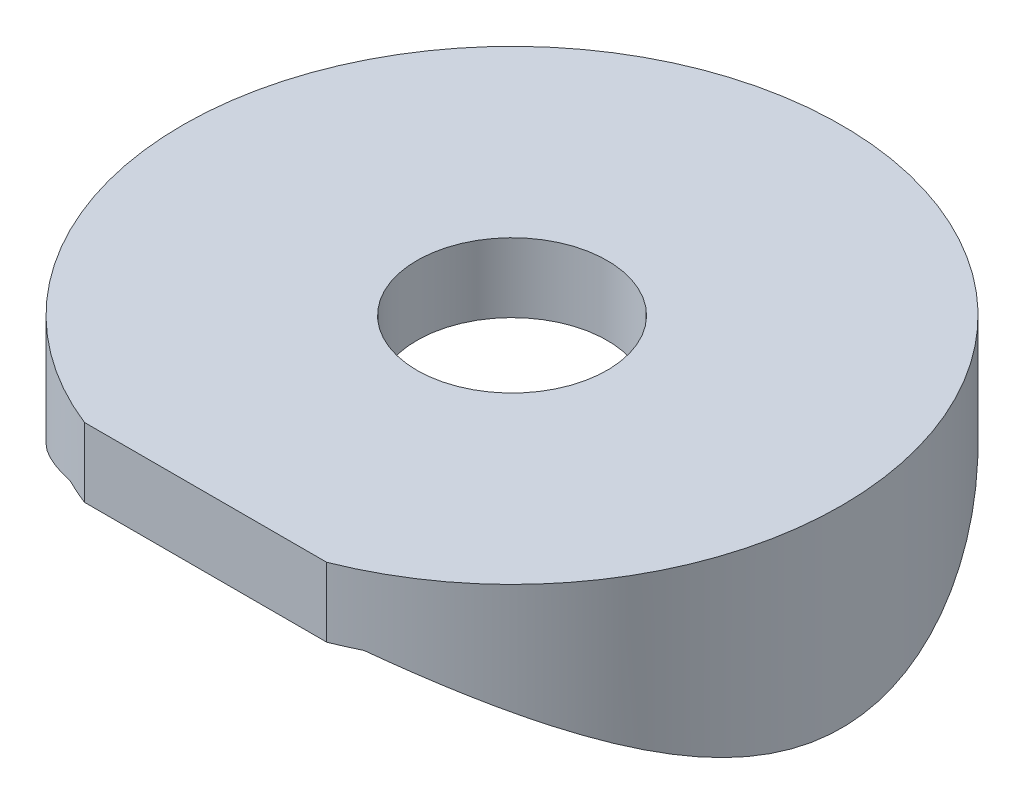
ISO-10303-21;
HEADER;
FILE_DESCRIPTION(('STEP AP214'),'2;1');
FILE_NAME('part.step','',(''),(''),'','','');
FILE_SCHEMA(('AUTOMOTIVE_DESIGN { 1 0 10303 214 1 1 1 1 }'));
ENDSEC;
DATA;
#1=APPLICATION_CONTEXT('core data for automotive mechanical design processes');
#2=APPLICATION_PROTOCOL_DEFINITION('international standard','automotive_design',2000,#1);
#3=PRODUCT_CONTEXT('',#1,'mechanical');
#4=PRODUCT('Part','Part','',(#3));
#5=PRODUCT_RELATED_PRODUCT_CATEGORY('part','',(#4));
#6=PRODUCT_DEFINITION_FORMATION('','',#4);
#7=PRODUCT_DEFINITION_CONTEXT('part definition',#1,'design');
#8=PRODUCT_DEFINITION('design','',#6,#7);
#9=PRODUCT_DEFINITION_SHAPE('','',#8);
#10=(LENGTH_UNIT() NAMED_UNIT(*) SI_UNIT(.MILLI.,.METRE.));
#11=(NAMED_UNIT(*) PLANE_ANGLE_UNIT() SI_UNIT($,.RADIAN.));
#12=(NAMED_UNIT(*) SI_UNIT($,.STERADIAN.) SOLID_ANGLE_UNIT());
#13=UNCERTAINTY_MEASURE_WITH_UNIT(LENGTH_MEASURE(1.E-05),#10,'distance_accuracy_value','');
#14=(GEOMETRIC_REPRESENTATION_CONTEXT(3) GLOBAL_UNCERTAINTY_ASSIGNED_CONTEXT((#13)) GLOBAL_UNIT_ASSIGNED_CONTEXT((#10,
#11,#12)) REPRESENTATION_CONTEXT('',''));
#15=CARTESIAN_POINT('',(0.,0.,0.));
#16=DIRECTION('',(0.,0.,1.));
#17=DIRECTION('',(1.,0.,0.));
#18=AXIS2_PLACEMENT_3D('',#15,#16,#17);
#19=CARTESIAN_POINT('',(0.,2.,0.));
#20=DIRECTION('',(0.,-1.,0.));
#21=DIRECTION('',(0.,0.,-1.));
#22=AXIS2_PLACEMENT_3D('',#19,#20,#21);
#23=CYLINDRICAL_SURFACE('',#22,9.525);
#24=CARTESIAN_POINT('',(0.,0.,0.));
#25=DIRECTION('',(0.,1.,0.));
#26=DIRECTION('',(0.,0.,1.));
#27=AXIS2_PLACEMENT_3D('',#24,#25,#26);
#28=CIRCLE('',#27,9.525);
#29=CARTESIAN_POINT('',(-4.24371299732805,0.,8.52739848935823));
#30=VERTEX_POINT('',#29);
#31=CARTESIAN_POINT('',(-3.5,0.,8.85864690570744));
#32=VERTEX_POINT('',#31);
#33=EDGE_CURVE('E97',#30,#32,#28,.T.);
#34=ORIENTED_EDGE('',*,*,#33,.T.);
#35=DIRECTION('',(0.,1.,0.));
#36=VECTOR('',#35,1.);
#37=CARTESIAN_POINT('',(-3.5,-4.28727802149109,8.85864690570744));
#38=LINE('',#37,#36);
#39=CARTESIAN_POINT('',(-3.5,2.,8.85864690570744));
#40=VERTEX_POINT('',#39);
#41=EDGE_CURVE('E57',#32,#40,#38,.T.);
#42=ORIENTED_EDGE('',*,*,#41,.T.);
#43=CARTESIAN_POINT('',(0.,2.,0.));
#44=DIRECTION('',(0.,1.,0.));
#45=DIRECTION('',(0.,0.,1.));
#46=AXIS2_PLACEMENT_3D('',#43,#44,#45);
#47=CIRCLE('',#46,9.525);
#48=CARTESIAN_POINT('',(3.5,2.,8.85864690570744));
#49=VERTEX_POINT('',#48);
#50=EDGE_CURVE('E50',#49,#40,#47,.T.);
#51=ORIENTED_EDGE('',*,*,#50,.F.);
#52=DIRECTION('',(0.,1.,0.));
#53=VECTOR('',#52,1.);
#54=CARTESIAN_POINT('',(3.5,-4.28727802149109,8.85864690570744));
#55=LINE('',#54,#53);
#56=CARTESIAN_POINT('',(3.5,0.,8.85864690570744));
#57=VERTEX_POINT('',#56);
#58=EDGE_CURVE('E80',#57,#49,#55,.T.);
#59=ORIENTED_EDGE('',*,*,#58,.F.);
#60=CARTESIAN_POINT('',(4.24371299645719,0.,8.52739848979162));
#61=VERTEX_POINT('',#60);
#62=EDGE_CURVE('E98',#57,#61,#28,.T.);
#63=ORIENTED_EDGE('',*,*,#62,.T.);
#64=CARTESIAN_POINT('',(0.,0.729999999999805,9.525));
#65=CARTESIAN_POINT('',(-0.23259841021261,0.729997784888119,9.52499770537466));
#66=CARTESIAN_POINT('',(-0.465255043655227,0.723594419249515,9.51646441280729));
#67=CARTESIAN_POINT('',(-0.928731542195356,0.698124794112433,9.48246454254012));
#68=CARTESIAN_POINT('',(-1.15955022455056,0.679050957577417,9.45698783253917));
#69=CARTESIAN_POINT('',(-1.61788138906219,0.628639507989334,9.38945410865459));
#70=CARTESIAN_POINT('',(-1.84538601283839,0.597276517735044,9.3473627841225));
#71=CARTESIAN_POINT('',(-2.2949502467773,0.52300312294065,9.2472632046122));
#72=CARTESIAN_POINT('',(-2.51700921202464,0.480091357845787,9.18925307423248));
#73=CARTESIAN_POINT('',(-2.952876191942,0.383947739227021,9.05856475719301));
#74=CARTESIAN_POINT('',(-3.16672702845038,0.330781918974894,8.98598030840878));
#75=CARTESIAN_POINT('',(-3.58650782409441,0.215006184306209,8.82683302994353));
#76=CARTESIAN_POINT('',(-3.79243753835999,0.152395978224062,8.74026976855698));
#77=CARTESIAN_POINT('',(-4.19537242078881,0.0189061872306335,8.55416263233198));
#78=CARTESIAN_POINT('',(-4.39238304194526,-0.0519682476247925,8.45462683713943));
#79=CARTESIAN_POINT('',(-4.77703365277123,-0.200866503976882,8.24340590595757));
#80=CARTESIAN_POINT('',(-4.96467037097833,-0.278892794887664,8.13171657104755));
#81=CARTESIAN_POINT('',(-5.34692015142942,-0.448364136168589,7.8862109865343));
#82=CARTESIAN_POINT('',(-5.54057769571428,-0.540382977212998,7.75130388741133));
#83=CARTESIAN_POINT('',(-5.91568315666102,-0.729943727724393,7.46896507493376));
#84=CARTESIAN_POINT('',(-6.09712948397992,-0.827486353105227,7.3215317368628));
#85=CARTESIAN_POINT('',(-6.44778420778648,-1.02665526255018,7.01470349487024));
#86=CARTESIAN_POINT('',(-6.61697329942977,-1.12828761242709,6.85529049451129));
#87=CARTESIAN_POINT('',(-6.94253873875901,-1.3338253101456,6.52537216797456));
#88=CARTESIAN_POINT('',(-7.09891856081364,-1.43773003187955,6.35486987230249));
#89=CARTESIAN_POINT('',(-7.42924361454595,-1.6673503710911,5.96735473559504));
#90=CARTESIAN_POINT('',(-7.60028683020509,-1.79320133907598,5.74793814875554));
#91=CARTESIAN_POINT('',(-7.92317135810628,-2.04251439300869,5.2940157499132));
#92=CARTESIAN_POINT('',(-8.07500688013017,-2.16597574914572,5.05950541984679));
#93=CARTESIAN_POINT('',(-8.35856892365196,-2.40658801370607,4.57585064368803));
#94=CARTESIAN_POINT('',(-8.4903155443376,-2.52374515259294,4.32672117454368));
#95=CARTESIAN_POINT('',(-8.73266391869301,-2.74732401379134,3.81400842020836));
#96=CARTESIAN_POINT('',(-8.84327771031342,-2.85375183145663,3.55043347441776));
#97=CARTESIAN_POINT('',(-9.0728908228853,-3.0814481821903,2.92423440351913));
#98=CARTESIAN_POINT('',(-9.18375570493701,-3.19700125106876,2.55634618968797));
#99=CARTESIAN_POINT('',(-9.31693272394488,-3.33929966169199,1.98949342968806));
#100=CARTESIAN_POINT('',(-9.35579238340954,-3.38154546641803,1.79815152694915));
#101=CARTESIAN_POINT('',(-9.42190755651968,-3.45412803329214,1.41128534341628));
#102=CARTESIAN_POINT('',(-9.44916905018073,-3.48447093194927,1.21576327266876));
#103=CARTESIAN_POINT('',(-9.49175093121314,-3.53212661427137,0.819931641701291));
#104=CARTESIAN_POINT('',(-9.50695584288829,-3.54931333772008,0.619594283029923));
#105=CARTESIAN_POINT('',(-9.52463756517548,-3.56931773946365,0.217634688525825));
#106=CARTESIAN_POINT('',(-9.5271147250272,-3.57213581202318,0.0160124881001599));
#107=CARTESIAN_POINT('',(-9.51927797471908,-3.56325395273591,-0.386721449746217));
#108=CARTESIAN_POINT('',(-9.50895987824097,-3.55154926937138,-0.587832998516868));
#109=CARTESIAN_POINT('',(-9.47577623693442,-3.51421608975241,-0.987696956026981));
#110=CARTESIAN_POINT('',(-9.45291056426838,-3.48858745163753,-1.18644934070965));
#111=CARTESIAN_POINT('',(-9.39823752218467,-3.42806853030904,-1.55894115029253));
#112=CARTESIAN_POINT('',(-9.36765398503441,-3.39446829507869,-1.73307473267046));
#113=CARTESIAN_POINT('',(-9.29733840592979,-3.31828412768323,-2.07751040135897));
#114=CARTESIAN_POINT('',(-9.25760310062014,-3.27569699140634,-2.24781109709618));
#115=CARTESIAN_POINT('',(-9.1253348977206,-3.13627797752672,-2.75221284378597));
#116=CARTESIAN_POINT('',(-9.01974467644837,-3.02779425009011,-3.07978065848045));
#117=CARTESIAN_POINT('',(-8.80004440363324,-2.81203662342191,-3.65531877636064));
#118=CARTESIAN_POINT('',(-8.69120308439111,-2.70831623291411,-3.90673413666691));
#119=CARTESIAN_POINT('',(-8.45417087506931,-2.49145559781081,-4.39619617473415));
#120=CARTESIAN_POINT('',(-8.32597006151514,-2.37831053564163,-4.63423590992921));
#121=CARTESIAN_POINT('',(-8.05095146899372,-2.14632334880252,-5.0971022097166));
#122=CARTESIAN_POINT('',(-7.90409559569967,-2.02746988523204,-5.32190031942103));
#123=CARTESIAN_POINT('',(-7.59262434407657,-1.78762834741461,-5.75754782188368));
#124=CARTESIAN_POINT('',(-7.42801175020223,-1.66664061032761,-5.96839939327584));
#125=CARTESIAN_POINT('',(-7.07704198235579,-1.42237752024943,-6.38093102297909));
#126=CARTESIAN_POINT('',(-6.8902407182611,-1.29912153943826,-6.58224508385465));
#127=CARTESIAN_POINT('',(-6.49870467122047,-1.05625102841345,-6.96908847989323));
#128=CARTESIAN_POINT('',(-6.29396807626398,-0.936636867782604,-7.154616216419));
#129=CARTESIAN_POINT('',(-5.86731757424881,-0.703965573125999,-7.50845411558424));
#130=CARTESIAN_POINT('',(-5.64543332705745,-0.590897683703235,-7.67679288824356));
#131=CARTESIAN_POINT('',(-5.1847666626012,-0.373750997506853,-7.99513322842824));
#132=CARTESIAN_POINT('',(-4.94598858625621,-0.269669906700883,-8.14513947972538));
#133=CARTESIAN_POINT('',(-4.50194089752363,-0.0928099684937161,-8.39699949060933));
#134=CARTESIAN_POINT('',(-4.29955325197172,-0.0179393545510051,-8.50247725145005));
#135=CARTESIAN_POINT('',(-3.88524637166804,0.123085541359482,-8.69960271376244));
#136=CARTESIAN_POINT('',(-3.67332910828406,0.189241615056706,-8.79125325870626));
#137=CARTESIAN_POINT('',(-3.24094504112411,0.31156060210267,-8.95967102713244));
#138=CARTESIAN_POINT('',(-3.02048147525959,0.367727255904571,-9.03644382243031));
#139=CARTESIAN_POINT('',(-2.57214112585905,0.468926522423023,-9.17413201803592));
#140=CARTESIAN_POINT('',(-2.34426424715868,0.513958992146676,-9.23504721468993));
#141=CARTESIAN_POINT('',(-1.88117485035226,0.592111886440313,-9.34042496004337));
#142=CARTESIAN_POINT('',(-1.64592540399988,0.625156151843665,-9.38478236945888));
#143=CARTESIAN_POINT('',(-1.17129174753272,0.678125875778509,-9.45575338516204));
#144=CARTESIAN_POINT('',(-0.931907527351278,0.698051302365816,-9.48236694824367));
#145=CARTESIAN_POINT('',(-0.451142730954666,0.724266652119009,-9.51736126052943));
#146=CARTESIAN_POINT('',(-0.209762847438576,0.73056112233819,-9.52574808986271));
#147=CARTESIAN_POINT('',(0.272890152536329,0.72936043157876,-9.52414731523175));
#148=CARTESIAN_POINT('',(0.514163275909657,0.721866357204784,-9.51416115914847));
#149=CARTESIAN_POINT('',(0.970221531004669,0.694734031875467,-9.47793420082518));
#150=CARTESIAN_POINT('',(1.18522594166334,0.676395578326863,-9.45343269025608));
#151=CARTESIAN_POINT('',(1.61193413475926,0.629116805106362,-9.39009127706114));
#152=CARTESIAN_POINT('',(1.82363781860707,0.600176169387875,-9.35125094700086));
#153=CARTESIAN_POINT('',(2.24240408758311,0.532264940695811,-9.25976200832545));
#154=CARTESIAN_POINT('',(2.44946630605082,0.493293558340478,-9.20711231295937));
#155=CARTESIAN_POINT('',(2.85778253134699,0.406052442909976,-9.08866888869828));
#156=CARTESIAN_POINT('',(3.05903624736119,0.357782245196468,-9.02287450299018));
#157=CARTESIAN_POINT('',(3.4617083269491,0.250943607375551,-8.87635576558735));
#158=CARTESIAN_POINT('',(3.66288564193724,0.192073722945955,-8.79518925903764));
#159=CARTESIAN_POINT('',(4.05718446805025,0.0662840212472638,-8.6204077023608));
#160=CARTESIAN_POINT('',(4.25030324937319,-0.000638494485306451,-8.52678847817238));
#161=CARTESIAN_POINT('',(4.81639459045338,-0.211839639111846,-8.2285927945998));
#162=CARTESIAN_POINT('',(5.17640496565212,-0.366634718909772,-8.00656644797463));
#163=CARTESIAN_POINT('',(5.91519395536679,-0.722972839233144,-7.48161937180489));
#164=CARTESIAN_POINT('',(6.28706649731194,-0.928005707306838,-7.17138137049225));
#165=CARTESIAN_POINT('',(6.80424268305122,-1.24463586284191,-6.66976691930901));
#166=CARTESIAN_POINT('',(6.97007726772597,-1.35185774053343,-6.49623611811186));
#167=CARTESIAN_POINT('',(7.28787473292322,-1.56741903807525,-6.13757980417725));
#168=CARTESIAN_POINT('',(7.43984095984432,-1.67575818127239,-5.95245710680976));
#169=CARTESIAN_POINT('',(7.75723803959675,-1.91209280619687,-5.53463917245937));
#170=CARTESIAN_POINT('',(7.91972498285248,-2.03990407083125,-5.29959643208612));
#171=CARTESIAN_POINT('',(8.22407002240782,-2.29045843005951,-4.81377999915086));
#172=CARTESIAN_POINT('',(8.36592053940364,-2.4131996507461,-4.56300057501169));
#173=CARTESIAN_POINT('',(8.62755269876529,-2.64872132955173,-4.0465503829478));
#174=CARTESIAN_POINT('',(8.74738621646805,-2.76152486692327,-3.78091659342827));
#175=CARTESIAN_POINT('',(8.96374931355656,-2.97200160856855,-3.23465027285423));
#176=CARTESIAN_POINT('',(9.06029821315729,-3.06968733243597,-2.95403041418087));
#177=CARTESIAN_POINT('',(9.19538088935442,-3.20983797390683,-2.4908045696685));
#178=CARTESIAN_POINT('',(9.24187536148948,-3.25900515137353,-2.31251593822632));
#179=CARTESIAN_POINT('',(9.32482041089155,-3.34785295020121,-1.95132131394081));
#180=CARTESIAN_POINT('',(9.3612745105815,-3.38753689787669,-1.76841696505656));
#181=CARTESIAN_POINT('',(9.42353800002562,-3.45594828537038,-1.39912452363777));
#182=CARTESIAN_POINT('',(9.44936706454788,-3.48469596877603,-1.2127435443255));
#183=CARTESIAN_POINT('',(9.49000430530305,-3.53016851926707,-0.837308190396584));
#184=CARTESIAN_POINT('',(9.50481245368979,-3.54689335597475,-0.64825380902638));
#185=CARTESIAN_POINT('',(9.52314437277674,-3.5676242130476,-0.267912069737743));
#186=CARTESIAN_POINT('',(9.52660955944379,-3.57156420142794,-0.0766182242763531));
#187=CARTESIAN_POINT('',(9.52201366907967,-3.56635398984623,0.305644636916303));
#188=CARTESIAN_POINT('',(9.51395283427858,-3.55720406498089,0.496613659389582));
#189=CARTESIAN_POINT('',(9.4864681491766,-3.52622444474029,0.876886431537154));
#190=CARTESIAN_POINT('',(9.4670322781806,-3.50438133587622,1.06618820419404));
#191=CARTESIAN_POINT('',(9.41717883106189,-3.44896005235281,1.44161378012445));
#192=CARTESIAN_POINT('',(9.38675856551961,-3.41537900384034,1.62773679341223));
#193=CARTESIAN_POINT('',(9.30767924599566,-3.32932726055876,2.03589019389486));
#194=CARTESIAN_POINT('',(9.25648934049246,-3.27433411176482,2.25689863361022));
#195=CARTESIAN_POINT('',(9.13962283851279,-3.15158422063216,2.69138962789313));
#196=CARTESIAN_POINT('',(9.07394260397842,-3.08382427358377,2.90487027683401));
#197=CARTESIAN_POINT('',(8.92891861579014,-2.93811255326498,3.32405323606375));
#198=CARTESIAN_POINT('',(8.84954684630538,-2.86013996306052,3.52973852153503));
#199=CARTESIAN_POINT('',(8.67804737840063,-2.69662200146044,3.93256277871633));
#200=CARTESIAN_POINT('',(8.58591891894682,-2.61107617837363,4.12970123962107));
#201=CARTESIAN_POINT('',(8.35544253942744,-2.40401039255514,4.58226872123221));
#202=CARTESIAN_POINT('',(8.21214891635245,-2.28030703754029,4.83419018389892));
#203=CARTESIAN_POINT('',(7.90459935311607,-2.02782027438362,5.32223267250688));
#204=CARTESIAN_POINT('',(7.74033688144773,-1.89903529205759,5.55834874020355));
#205=CARTESIAN_POINT('',(7.39140210767579,-1.64021778111099,6.01459276963808));
#206=CARTESIAN_POINT('',(7.20671452158477,-1.51018438566494,6.23470855154307));
#207=CARTESIAN_POINT('',(6.81750117880933,-1.25243678767049,6.65807524378056));
#208=CARTESIAN_POINT('',(6.61297783310861,-1.1247223054991,6.86132819818651));
#209=CARTESIAN_POINT('',(6.18265774645006,-0.87372545992438,7.25158134680864));
#210=CARTESIAN_POINT('',(5.95669661990892,-0.750489382197967,7.43843054372597));
#211=CARTESIAN_POINT('',(5.4854650864741,-0.512717734640243,7.79244058960457));
#212=CARTESIAN_POINT('',(5.24019216189196,-0.398183303084047,7.95959886433642));
#213=CARTESIAN_POINT('',(4.73172065530556,-0.181145579743702,8.27195851994352));
#214=CARTESIAN_POINT('',(4.46855745715055,-0.0786195720502155,8.41720151234697));
#215=CARTESIAN_POINT('',(3.92535711672087,0.111566788079673,8.68381302579842));
#216=CARTESIAN_POINT('',(3.64532878095762,0.199234809279538,8.80519386820266));
#217=CARTESIAN_POINT('',(3.1548375563506,0.333715881047147,8.98998255599371));
#218=CARTESIAN_POINT('',(2.94803837877842,0.38497253208549,9.05995519751822));
#219=CARTESIAN_POINT('',(2.52811536014908,0.477683378873101,9.18598243922957));
#220=CARTESIAN_POINT('',(2.31499306882355,0.519139954546655,9.24204041872374));
#221=CARTESIAN_POINT('',(1.88415726149766,0.591351791291087,9.3393921613162));
#222=CARTESIAN_POINT('',(1.66645561401046,0.622131787589644,9.38072005690495));
#223=CARTESIAN_POINT('',(1.22750630938477,0.672467167505125,9.44818018781657));
#224=CARTESIAN_POINT('',(1.00626052524085,0.692028291149189,9.47432019396501));
#225=CARTESIAN_POINT('',(0.653841602087975,0.713829749064051,9.50343133829388));
#226=CARTESIAN_POINT('',(0.523297100891183,0.719888168483563,9.51151406370804));
#227=CARTESIAN_POINT('',(0.261841253055912,0.72797424182913,9.52229947342016));
#228=CARTESIAN_POINT('',(0.130929850758752,0.730001246888132,9.52500129164664));
#229=CARTESIAN_POINT('',(0.,0.729999999999805,9.525));
#230=B_SPLINE_CURVE_WITH_KNOTS('',3,(#64,#65,#66,#67,#68,#69,#70,#71,#72,#73,#74,#75,#76,#77,
#78,#79,#80,#81,#82,#83,#84,#85,#86,#87,#88,#89,#90,#91,#92,#93,#94,#95,#96,#97,#98,#99,#100,
#101,#102,#103,#104,#105,#106,#107,#108,#109,#110,#111,#112,#113,#114,#115,#116,#117,#118,#119,
#120,#121,#122,#123,#124,#125,#126,#127,#128,#129,#130,#131,#132,#133,#134,#135,#136,#137,#138,
#139,#140,#141,#142,#143,#144,#145,#146,#147,#148,#149,#150,#151,#152,#153,#154,#155,#156,#157,
#158,#159,#160,#161,#162,#163,#164,#165,#166,#167,#168,#169,#170,#171,#172,#173,#174,#175,#176,
#177,#178,#179,#180,#181,#182,#183,#184,#185,#186,#187,#188,#189,#190,#191,#192,#193,#194,#195,
#196,#197,#198,#199,#200,#201,#202,#203,#204,#205,#206,#207,#208,#209,#210,#211,#212,#213,#214,
#215,#216,#217,#218,#219,#220,#221,#222,#223,#224,#225,#226,#227,#228,#229),.UNSPECIFIED.,.T.,
.F.,(4,2,2,2,2,2,2,2,2,2,2,2,2,2,2,2,2,2,2,2,2,2,2,2,2,2,2,2,2,2,2,2,2,2,2,2,2,2,2,2,2,2,2,2,2,
2,2,2,2,2,2,2,2,2,2,2,2,2,2,2,2,2,2,2,2,2,2,2,2,2,2,2,2,2,2,2,2,2,2,2,2,2,4),(0.,
0.697653939196018,1.39572545670426,2.0952461595187,2.79484930858118,3.490089187134,
4.18535054078137,4.88018091788164,5.57525211839206,6.33450107353498,7.09384865787659,
7.85436730562852,8.61467898352172,9.52972294094343,10.4450420871583,11.3594393501723,
12.2733141793507,13.4720636534696,14.0707617500478,14.6691507826126,15.2732040895598,
15.8772408216617,16.4814752330625,17.0857158006577,17.6250720980969,18.1646210188324,
19.2438192312037,20.1215866650861,20.9998055703143,21.8798475620017,22.7597517532091,
23.6618728892802,24.5640852721984,25.4647706209213,26.365225370531,27.0851175986406,
27.8048615834668,28.5243354962807,29.2438186485966,29.9677956755324,30.6917744653355,
31.4155117110034,32.1391919250856,32.7899506226689,33.440728720674,34.0915580481166,
34.7424199042975,35.4160747980962,36.0899560678779,37.4367284882647,39.0084124228873,
39.7965847597898,40.584566407098,41.5225526126182,42.4608824547177,43.39697227694,
44.3322826934654,44.903904553405,45.4753256173941,46.0456837444518,46.6160433126088,
47.1893440594896,47.7626327580979,48.3365283825732,48.9105646150567,49.6097971206743,
50.309205381387,51.0100621368708,51.7109607218326,52.655045561529,53.5994251914717,
54.5445163385014,55.4894927558448,56.4424133450623,57.395458373359,58.3466704027056,
59.2973899707615,59.9694860147283,60.6414186737586,61.3117840525346,61.9818061387018,
62.3744529654437,62.7671629846425),.UNSPECIFIED.);
#231=CARTESIAN_POINT('',(4.24371299645719,0.,-8.52739848979162));
#232=VERTEX_POINT('',#231);
#233=EDGE_CURVE('E123',#232,#61,#230,.T.);
#234=ORIENTED_EDGE('',*,*,#233,.F.);
#235=CARTESIAN_POINT('',(-4.24371299732805,0.,-8.52739848935823));
#236=VERTEX_POINT('',#235);
#237=EDGE_CURVE('E94',#232,#236,#28,.T.);
#238=ORIENTED_EDGE('',*,*,#237,.T.);
#239=EDGE_CURVE('E63',#30,#236,#230,.T.);
#240=ORIENTED_EDGE('',*,*,#239,.F.);
#241=EDGE_LOOP('',(#34,#42,#51,#59,#63,#234,#238,#240));
#242=FACE_BOUND('',#241,.T.);
#243=ADVANCED_FACE('F43',(#242),#23,.T.);
#244=CARTESIAN_POINT('',(0.,2.,0.));
#245=DIRECTION('',(0.,1.,0.));
#246=DIRECTION('',(0.,0.,1.));
#247=AXIS2_PLACEMENT_3D('',#244,#245,#246);
#248=PLANE('',#247);
#249=DIRECTION('',(-1.,0.,0.));
#250=VECTOR('',#249,1.);
#251=CARTESIAN_POINT('',(-3.5,2.,8.85864690570744));
#252=LINE('',#251,#250);
#253=EDGE_CURVE('E83',#49,#40,#252,.T.);
#254=ORIENTED_EDGE('',*,*,#253,.F.);
#255=ORIENTED_EDGE('',*,*,#50,.T.);
#256=EDGE_LOOP('',(#254,#255));
#257=FACE_BOUND('',#256,.T.);
#258=CARTESIAN_POINT('',(0.,2.,0.));
#259=DIRECTION('',(0.,1.,0.));
#260=DIRECTION('',(0.,0.,1.));
#261=AXIS2_PLACEMENT_3D('',#258,#259,#260);
#262=CIRCLE('',#261,2.74999999999999);
#263=CARTESIAN_POINT('',(0.,2.,2.74999999999999));
#264=VERTEX_POINT('',#263);
#265=EDGE_CURVE('E106',#264,#264,#262,.T.);
#266=ORIENTED_EDGE('',*,*,#265,.F.);
#267=EDGE_LOOP('',(#266));
#268=FACE_BOUND('',#267,.T.);
#269=ADVANCED_FACE('F90',(#257,#268),#248,.T.);
#270=CARTESIAN_POINT('',(0.,0.,0.));
#271=DIRECTION('',(0.,1.,0.));
#272=DIRECTION('',(0.,0.,1.));
#273=AXIS2_PLACEMENT_3D('',#270,#271,#272);
#274=PLANE('',#273);
#275=CARTESIAN_POINT('',(0.,0.,0.));
#276=DIRECTION('',(0.,1.,0.));
#277=DIRECTION('',(0.,0.,1.));
#278=AXIS2_PLACEMENT_3D('',#275,#276,#277);
#279=CIRCLE('',#278,2.75);
#280=CARTESIAN_POINT('',(0.,0.,2.75));
#281=VERTEX_POINT('',#280);
#282=EDGE_CURVE('E100',#281,#281,#279,.T.);
#283=ORIENTED_EDGE('',*,*,#282,.T.);
#284=EDGE_LOOP('',(#283));
#285=FACE_BOUND('',#284,.T.);
#286=ORIENTED_EDGE('',*,*,#62,.F.);
#287=DIRECTION('',(-1.,0.,0.));
#288=VECTOR('',#287,1.);
#289=CARTESIAN_POINT('',(0.,0.,8.85864690570744));
#290=LINE('',#289,#288);
#291=EDGE_CURVE('E11',#57,#32,#290,.T.);
#292=ORIENTED_EDGE('',*,*,#291,.T.);
#293=ORIENTED_EDGE('',*,*,#33,.F.);
#294=DIRECTION('',(0.,0.,-1.));
#295=VECTOR('',#294,1.);
#296=CARTESIAN_POINT('',(-4.24371299732805,0.,49.9999999999869));
#297=LINE('',#296,#295);
#298=EDGE_CURVE('E114',#30,#236,#297,.T.);
#299=ORIENTED_EDGE('',*,*,#298,.T.);
#300=ORIENTED_EDGE('',*,*,#237,.F.);
#301=DIRECTION('',(0.,0.,-1.));
#302=VECTOR('',#301,1.);
#303=CARTESIAN_POINT('',(4.24371299645719,0.,49.9999999999869));
#304=LINE('',#303,#302);
#305=EDGE_CURVE('E110',#232,#61,#304,.F.);
#306=ORIENTED_EDGE('',*,*,#305,.T.);
#307=EDGE_LOOP('',(#286,#292,#293,#299,#300,#306));
#308=FACE_BOUND('',#307,.T.);
#309=ADVANCED_FACE('F136',(#285,#308),#274,.F.);
#310=CARTESIAN_POINT('',(0.,2.,0.));
#311=DIRECTION('',(0.,1.,0.));
#312=DIRECTION('',(0.,0.,1.));
#313=AXIS2_PLACEMENT_3D('',#310,#311,#312);
#314=CYLINDRICAL_SURFACE('',#313,2.74999999999999);
#315=ORIENTED_EDGE('',*,*,#282,.F.);
#316=EDGE_LOOP('',(#315));
#317=FACE_BOUND('',#316,.T.);
#318=ORIENTED_EDGE('',*,*,#265,.T.);
#319=EDGE_LOOP('',(#318));
#320=FACE_BOUND('',#319,.T.);
#321=ADVANCED_FACE('F133',(#317,#320),#314,.F.);
#322=CARTESIAN_POINT('',(-4.35429470257986E-10,-11.9700000000002,49.9999999999869));
#323=DIRECTION('',(0.,0.,-1.));
#324=DIRECTION('',(-1.,0.,0.));
#325=AXIS2_PLACEMENT_3D('',#322,#323,#324);
#326=CYLINDRICAL_SURFACE('',#325,12.7);
#327=ORIENTED_EDGE('',*,*,#298,.F.);
#328=ORIENTED_EDGE('',*,*,#239,.T.);
#329=EDGE_LOOP('',(#327,#328));
#330=FACE_BOUND('',#329,.T.);
#331=ADVANCED_FACE('F131',(#330),#326,.F.);
#332=ORIENTED_EDGE('',*,*,#305,.F.);
#333=ORIENTED_EDGE('',*,*,#233,.T.);
#334=EDGE_LOOP('',(#332,#333));
#335=FACE_BOUND('',#334,.T.);
#336=ADVANCED_FACE('F127',(#335),#326,.F.);
#337=CARTESIAN_POINT('',(-3.5,-4.28727802149109,8.85864690570744));
#338=DIRECTION('',(0.,0.,-1.));
#339=DIRECTION('',(-1.,0.,0.));
#340=AXIS2_PLACEMENT_3D('',#337,#338,#339);
#341=PLANE('',#340);
#342=ORIENTED_EDGE('',*,*,#58,.T.);
#343=ORIENTED_EDGE('',*,*,#253,.T.);
#344=ORIENTED_EDGE('',*,*,#41,.F.);
#345=ORIENTED_EDGE('',*,*,#291,.F.);
#346=EDGE_LOOP('',(#342,#343,#344,#345));
#347=FACE_BOUND('',#346,.T.);
#348=ADVANCED_FACE('F82',(#347),#341,.F.);
#349=CLOSED_SHELL('',(#243,#269,#309,#321,#331,#336,#348));
#350=MANIFOLD_SOLID_BREP('B2',#349);
#351=ADVANCED_BREP_SHAPE_REPRESENTATION('',(#18,#350),#14);
#352=SHAPE_DEFINITION_REPRESENTATION(#9,#351);
ENDSEC;
END-ISO-10303-21;
